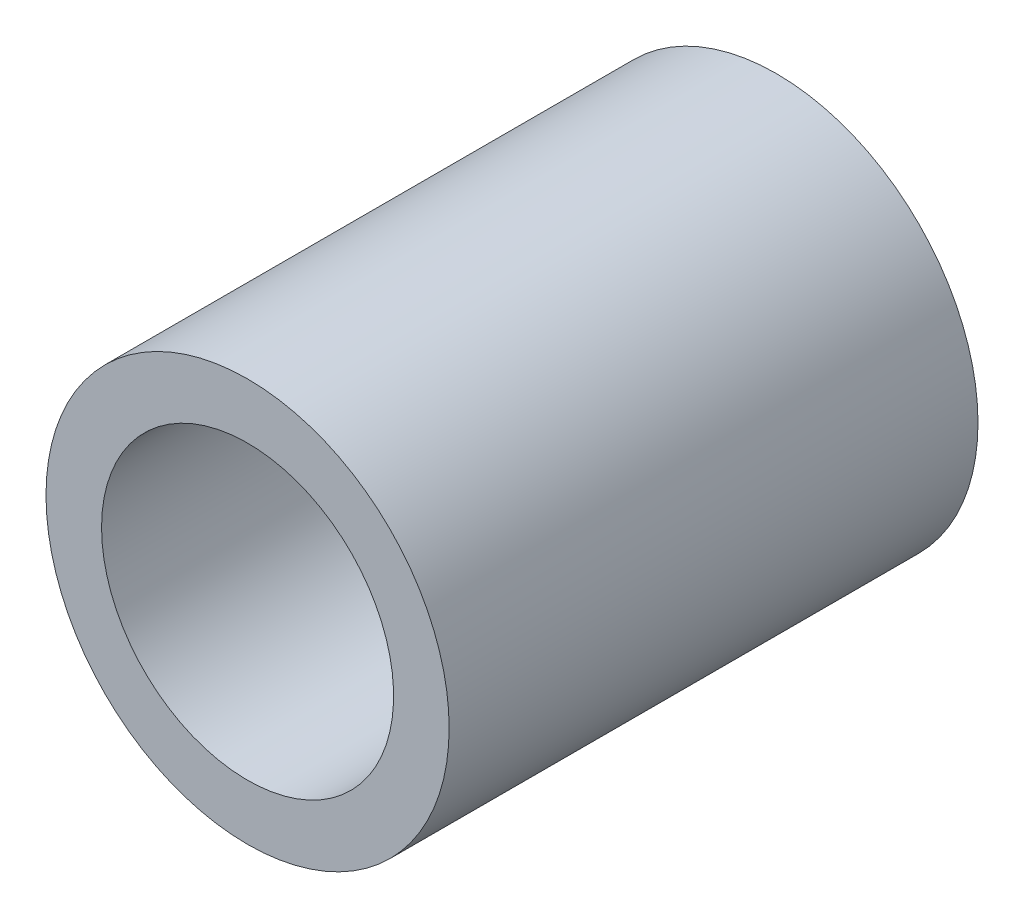
ISO-10303-21;
HEADER;
FILE_DESCRIPTION(('STEP AP214'),'2;1');
FILE_NAME('part.step','',(''),(''),'','','');
FILE_SCHEMA(('AUTOMOTIVE_DESIGN { 1 0 10303 214 1 1 1 1 }'));
ENDSEC;
DATA;
#1=APPLICATION_CONTEXT('core data for automotive mechanical design processes');
#2=APPLICATION_PROTOCOL_DEFINITION('international standard','automotive_design',2000,#1);
#3=PRODUCT_CONTEXT('',#1,'mechanical');
#4=PRODUCT('Part','Part','',(#3));
#5=PRODUCT_RELATED_PRODUCT_CATEGORY('part','',(#4));
#6=PRODUCT_DEFINITION_FORMATION('','',#4);
#7=PRODUCT_DEFINITION_CONTEXT('part definition',#1,'design');
#8=PRODUCT_DEFINITION('design','',#6,#7);
#9=PRODUCT_DEFINITION_SHAPE('','',#8);
#10=(LENGTH_UNIT() NAMED_UNIT(*) SI_UNIT(.MILLI.,.METRE.));
#11=(NAMED_UNIT(*) PLANE_ANGLE_UNIT() SI_UNIT($,.RADIAN.));
#12=(NAMED_UNIT(*) SI_UNIT($,.STERADIAN.) SOLID_ANGLE_UNIT());
#13=UNCERTAINTY_MEASURE_WITH_UNIT(LENGTH_MEASURE(1.E-05),#10,'distance_accuracy_value','');
#14=(GEOMETRIC_REPRESENTATION_CONTEXT(3) GLOBAL_UNCERTAINTY_ASSIGNED_CONTEXT((#13)) GLOBAL_UNIT_ASSIGNED_CONTEXT((#10,
#11,#12)) REPRESENTATION_CONTEXT('',''));
#15=CARTESIAN_POINT('',(0.,0.,0.));
#16=DIRECTION('',(0.,0.,1.));
#17=DIRECTION('',(1.,0.,0.));
#18=AXIS2_PLACEMENT_3D('',#15,#16,#17);
#19=CARTESIAN_POINT('',(0.,0.,10.14));
#20=DIRECTION('',(0.,0.,-1.));
#21=DIRECTION('',(-1.,0.,0.));
#22=AXIS2_PLACEMENT_3D('',#19,#20,#21);
#23=CYLINDRICAL_SURFACE('',#22,2.8);
#24=CARTESIAN_POINT('',(0.,0.,0.));
#25=DIRECTION('',(0.,0.,-1.));
#26=DIRECTION('',(-1.,0.,0.));
#27=AXIS2_PLACEMENT_3D('',#24,#25,#26);
#28=CIRCLE('',#27,2.8);
#29=CARTESIAN_POINT('',(-2.8,0.,0.));
#30=VERTEX_POINT('',#29);
#31=EDGE_CURVE('E26',#30,#30,#28,.T.);
#32=ORIENTED_EDGE('',*,*,#31,.T.);
#33=EDGE_LOOP('',(#32));
#34=FACE_BOUND('',#33,.T.);
#35=CARTESIAN_POINT('',(0.,0.,10.14));
#36=DIRECTION('',(0.,0.,-1.));
#37=DIRECTION('',(-1.,0.,0.));
#38=AXIS2_PLACEMENT_3D('',#35,#36,#37);
#39=CIRCLE('',#38,2.8);
#40=CARTESIAN_POINT('',(-2.8,0.,10.14));
#41=VERTEX_POINT('',#40);
#42=EDGE_CURVE('E17',#41,#41,#39,.T.);
#43=ORIENTED_EDGE('',*,*,#42,.F.);
#44=EDGE_LOOP('',(#43));
#45=FACE_BOUND('',#44,.T.);
#46=ADVANCED_FACE('F14',(#34,#45),#23,.F.);
#47=CARTESIAN_POINT('',(0.,0.,10.14));
#48=DIRECTION('',(0.,0.,1.));
#49=DIRECTION('',(1.,0.,0.));
#50=AXIS2_PLACEMENT_3D('',#47,#48,#49);
#51=PLANE('',#50);
#52=ORIENTED_EDGE('',*,*,#42,.T.);
#53=EDGE_LOOP('',(#52));
#54=FACE_BOUND('',#53,.T.);
#55=CARTESIAN_POINT('',(0.,0.,10.14));
#56=DIRECTION('',(0.,0.,-1.));
#57=DIRECTION('',(-1.,0.,0.));
#58=AXIS2_PLACEMENT_3D('',#55,#56,#57);
#59=CIRCLE('',#58,3.865);
#60=CARTESIAN_POINT('',(-3.865,0.,10.14));
#61=VERTEX_POINT('',#60);
#62=EDGE_CURVE('E21',#61,#61,#59,.T.);
#63=ORIENTED_EDGE('',*,*,#62,.F.);
#64=EDGE_LOOP('',(#63));
#65=FACE_BOUND('',#64,.T.);
#66=ADVANCED_FACE('F34',(#54,#65),#51,.T.);
#67=CARTESIAN_POINT('',(0.,0.,0.));
#68=DIRECTION('',(0.,0.,1.));
#69=DIRECTION('',(1.,0.,0.));
#70=AXIS2_PLACEMENT_3D('',#67,#68,#69);
#71=PLANE('',#70);
#72=ORIENTED_EDGE('',*,*,#31,.F.);
#73=EDGE_LOOP('',(#72));
#74=FACE_BOUND('',#73,.T.);
#75=CARTESIAN_POINT('',(0.,0.,0.));
#76=DIRECTION('',(0.,0.,-1.));
#77=DIRECTION('',(-1.,0.,0.));
#78=AXIS2_PLACEMENT_3D('',#75,#76,#77);
#79=CIRCLE('',#78,3.865);
#80=CARTESIAN_POINT('',(-3.865,0.,0.));
#81=VERTEX_POINT('',#80);
#82=EDGE_CURVE('E10',#81,#81,#79,.F.);
#83=ORIENTED_EDGE('',*,*,#82,.F.);
#84=EDGE_LOOP('',(#83));
#85=FACE_BOUND('',#84,.T.);
#86=ADVANCED_FACE('F42',(#74,#85),#71,.F.);
#87=CARTESIAN_POINT('',(0.,0.,10.14));
#88=DIRECTION('',(0.,0.,-1.));
#89=DIRECTION('',(-1.,0.,0.));
#90=AXIS2_PLACEMENT_3D('',#87,#88,#89);
#91=CYLINDRICAL_SURFACE('',#90,3.865);
#92=ORIENTED_EDGE('',*,*,#82,.T.);
#93=EDGE_LOOP('',(#92));
#94=FACE_BOUND('',#93,.T.);
#95=ORIENTED_EDGE('',*,*,#62,.T.);
#96=EDGE_LOOP('',(#95));
#97=FACE_BOUND('',#96,.T.);
#98=ADVANCED_FACE('F43',(#94,#97),#91,.T.);
#99=CLOSED_SHELL('',(#46,#66,#86,#98));
#100=MANIFOLD_SOLID_BREP('B1',#99);
#101=ADVANCED_BREP_SHAPE_REPRESENTATION('',(#18,#100),#14);
#102=SHAPE_DEFINITION_REPRESENTATION(#9,#101);
ENDSEC;
END-ISO-10303-21;
